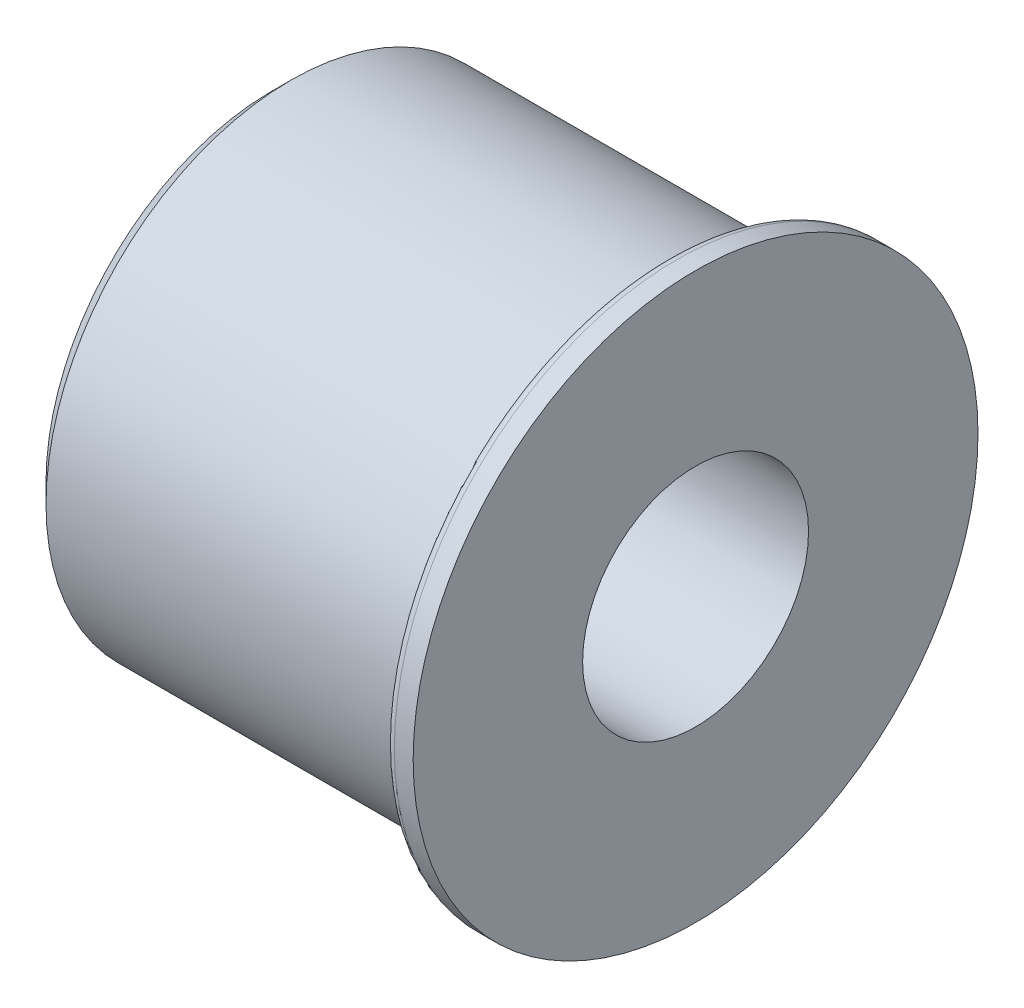
ISO-10303-21;
HEADER;
FILE_DESCRIPTION(('STEP AP214'),'2;1');
FILE_NAME('part.step','',(''),(''),'','','');
FILE_SCHEMA(('AUTOMOTIVE_DESIGN { 1 0 10303 214 1 1 1 1 }'));
ENDSEC;
DATA;
#1=APPLICATION_CONTEXT('core data for automotive mechanical design processes');
#2=APPLICATION_PROTOCOL_DEFINITION('international standard','automotive_design',2000,#1);
#3=PRODUCT_CONTEXT('',#1,'mechanical');
#4=PRODUCT('Part','Part','',(#3));
#5=PRODUCT_RELATED_PRODUCT_CATEGORY('part','',(#4));
#6=PRODUCT_DEFINITION_FORMATION('','',#4);
#7=PRODUCT_DEFINITION_CONTEXT('part definition',#1,'design');
#8=PRODUCT_DEFINITION('design','',#6,#7);
#9=PRODUCT_DEFINITION_SHAPE('','',#8);
#10=(LENGTH_UNIT() NAMED_UNIT(*) SI_UNIT(.MILLI.,.METRE.));
#11=(NAMED_UNIT(*) PLANE_ANGLE_UNIT() SI_UNIT($,.RADIAN.));
#12=(NAMED_UNIT(*) SI_UNIT($,.STERADIAN.) SOLID_ANGLE_UNIT());
#13=UNCERTAINTY_MEASURE_WITH_UNIT(LENGTH_MEASURE(1.E-05),#10,'distance_accuracy_value','');
#14=(GEOMETRIC_REPRESENTATION_CONTEXT(3) GLOBAL_UNCERTAINTY_ASSIGNED_CONTEXT((#13)) GLOBAL_UNIT_ASSIGNED_CONTEXT((#10,
#11,#12)) REPRESENTATION_CONTEXT('',''));
#15=CARTESIAN_POINT('',(0.,0.,0.));
#16=DIRECTION('',(0.,0.,1.));
#17=DIRECTION('',(1.,0.,0.));
#18=AXIS2_PLACEMENT_3D('',#15,#16,#17);
#19=CARTESIAN_POINT('',(0.,0.,0.));
#20=DIRECTION('',(-1.,0.,0.));
#21=DIRECTION('',(0.,0.,1.));
#22=AXIS2_PLACEMENT_3D('',#19,#20,#21);
#23=CYLINDRICAL_SURFACE('',#22,15.);
#24=CARTESIAN_POINT('',(21.5,0.,0.));
#25=DIRECTION('',(-1.,0.,0.));
#26=DIRECTION('',(0.,0.,1.));
#27=AXIS2_PLACEMENT_3D('',#24,#25,#26);
#28=CIRCLE('',#27,15.);
#29=CARTESIAN_POINT('',(21.5,0.,15.));
#30=VERTEX_POINT('',#29);
#31=EDGE_CURVE('E10',#30,#30,#28,.T.);
#32=ORIENTED_EDGE('',*,*,#31,.F.);
#33=EDGE_LOOP('',(#32));
#34=FACE_BOUND('',#33,.T.);
#35=CARTESIAN_POINT('',(22.5,0.,0.));
#36=DIRECTION('',(-1.,0.,0.));
#37=DIRECTION('',(0.,0.,1.));
#38=AXIS2_PLACEMENT_3D('',#35,#36,#37);
#39=CIRCLE('',#38,15.);
#40=CARTESIAN_POINT('',(22.5,0.,15.));
#41=VERTEX_POINT('',#40);
#42=EDGE_CURVE('E61',#41,#41,#39,.T.);
#43=ORIENTED_EDGE('',*,*,#42,.T.);
#44=EDGE_LOOP('',(#43));
#45=FACE_BOUND('',#44,.T.);
#46=ADVANCED_FACE('F33',(#34,#45),#23,.T.);
#47=CARTESIAN_POINT('',(21.5,0.,0.));
#48=DIRECTION('',(-1.,0.,0.));
#49=DIRECTION('',(0.,0.,1.));
#50=AXIS2_PLACEMENT_3D('',#47,#48,#49);
#51=TOROIDAL_SURFACE('',#50,14.5,0.500000000000001);
#52=CARTESIAN_POINT('',(21.,0.,0.));
#53=DIRECTION('',(-1.,0.,0.));
#54=DIRECTION('',(0.,0.,1.));
#55=AXIS2_PLACEMENT_3D('',#52,#53,#54);
#56=CIRCLE('',#55,14.5);
#57=CARTESIAN_POINT('',(21.,0.,14.5));
#58=VERTEX_POINT('',#57);
#59=EDGE_CURVE('E39',#58,#58,#56,.T.);
#60=ORIENTED_EDGE('',*,*,#59,.F.);
#61=EDGE_LOOP('',(#60));
#62=FACE_BOUND('',#61,.T.);
#63=ORIENTED_EDGE('',*,*,#31,.T.);
#64=EDGE_LOOP('',(#63));
#65=FACE_BOUND('',#64,.T.);
#66=ADVANCED_FACE('F98',(#62,#65),#51,.T.);
#67=CARTESIAN_POINT('',(21.,14.5,0.));
#68=DIRECTION('',(1.,0.,0.));
#69=DIRECTION('',(0.,0.,-1.));
#70=AXIS2_PLACEMENT_3D('',#67,#68,#69);
#71=PLANE('',#70);
#72=CARTESIAN_POINT('',(21.,0.,0.));
#73=DIRECTION('',(-1.,0.,0.));
#74=DIRECTION('',(0.,0.,1.));
#75=AXIS2_PLACEMENT_3D('',#72,#73,#74);
#76=CIRCLE('',#75,13.);
#77=CARTESIAN_POINT('',(21.,0.,13.));
#78=VERTEX_POINT('',#77);
#79=EDGE_CURVE('E43',#78,#78,#76,.T.);
#80=ORIENTED_EDGE('',*,*,#79,.F.);
#81=EDGE_LOOP('',(#80));
#82=FACE_BOUND('',#81,.T.);
#83=ORIENTED_EDGE('',*,*,#59,.T.);
#84=EDGE_LOOP('',(#83));
#85=FACE_BOUND('',#84,.T.);
#86=ADVANCED_FACE('F93',(#82,#85),#71,.F.);
#87=CARTESIAN_POINT('',(0.,0.,0.));
#88=DIRECTION('',(-1.,0.,0.));
#89=DIRECTION('',(0.,0.,1.));
#90=AXIS2_PLACEMENT_3D('',#87,#88,#89);
#91=CYLINDRICAL_SURFACE('',#90,13.);
#92=CARTESIAN_POINT('',(1.,0.,0.));
#93=DIRECTION('',(-1.,0.,0.));
#94=DIRECTION('',(0.,0.,1.));
#95=AXIS2_PLACEMENT_3D('',#92,#93,#94);
#96=CIRCLE('',#95,13.);
#97=CARTESIAN_POINT('',(1.,0.,13.));
#98=VERTEX_POINT('',#97);
#99=EDGE_CURVE('E47',#98,#98,#96,.T.);
#100=ORIENTED_EDGE('',*,*,#99,.F.);
#101=EDGE_LOOP('',(#100));
#102=FACE_BOUND('',#101,.T.);
#103=ORIENTED_EDGE('',*,*,#79,.T.);
#104=EDGE_LOOP('',(#103));
#105=FACE_BOUND('',#104,.T.);
#106=ADVANCED_FACE('F87',(#102,#105),#91,.T.);
#107=CARTESIAN_POINT('',(1.,0.,0.));
#108=DIRECTION('',(1.,0.,0.));
#109=DIRECTION('',(0.,0.,-1.));
#110=AXIS2_PLACEMENT_3D('',#107,#108,#109);
#111=CONICAL_SURFACE('',#110,13.,0.785398163397449);
#112=CARTESIAN_POINT('',(0.,0.,0.));
#113=DIRECTION('',(-1.,0.,0.));
#114=DIRECTION('',(0.,0.,1.));
#115=AXIS2_PLACEMENT_3D('',#112,#113,#114);
#116=CIRCLE('',#115,12.);
#117=CARTESIAN_POINT('',(0.,0.,12.));
#118=VERTEX_POINT('',#117);
#119=EDGE_CURVE('E52',#118,#118,#116,.T.);
#120=ORIENTED_EDGE('',*,*,#119,.F.);
#121=EDGE_LOOP('',(#120));
#122=FACE_BOUND('',#121,.T.);
#123=ORIENTED_EDGE('',*,*,#99,.T.);
#124=EDGE_LOOP('',(#123));
#125=FACE_BOUND('',#124,.T.);
#126=ADVANCED_FACE('F81',(#122,#125),#111,.T.);
#127=CARTESIAN_POINT('',(0.,6.,0.));
#128=DIRECTION('',(1.,0.,0.));
#129=DIRECTION('',(0.,0.,-1.));
#130=AXIS2_PLACEMENT_3D('',#127,#128,#129);
#131=PLANE('',#130);
#132=CARTESIAN_POINT('',(0.,0.,0.));
#133=DIRECTION('',(-1.,0.,0.));
#134=DIRECTION('',(0.,0.,1.));
#135=AXIS2_PLACEMENT_3D('',#132,#133,#134);
#136=CIRCLE('',#135,6.);
#137=CARTESIAN_POINT('',(0.,0.,6.));
#138=VERTEX_POINT('',#137);
#139=EDGE_CURVE('E55',#138,#138,#136,.T.);
#140=ORIENTED_EDGE('',*,*,#139,.F.);
#141=EDGE_LOOP('',(#140));
#142=FACE_BOUND('',#141,.T.);
#143=ORIENTED_EDGE('',*,*,#119,.T.);
#144=EDGE_LOOP('',(#143));
#145=FACE_BOUND('',#144,.T.);
#146=ADVANCED_FACE('F75',(#142,#145),#131,.F.);
#147=CARTESIAN_POINT('',(0.,0.,0.));
#148=DIRECTION('',(-1.,0.,0.));
#149=DIRECTION('',(0.,0.,1.));
#150=AXIS2_PLACEMENT_3D('',#147,#148,#149);
#151=CYLINDRICAL_SURFACE('',#150,6.);
#152=CARTESIAN_POINT('',(22.5,0.,0.));
#153=DIRECTION('',(-1.,0.,0.));
#154=DIRECTION('',(0.,0.,1.));
#155=AXIS2_PLACEMENT_3D('',#152,#153,#154);
#156=CIRCLE('',#155,6.);
#157=CARTESIAN_POINT('',(22.5,0.,6.));
#158=VERTEX_POINT('',#157);
#159=EDGE_CURVE('E58',#158,#158,#156,.T.);
#160=ORIENTED_EDGE('',*,*,#159,.F.);
#161=EDGE_LOOP('',(#160));
#162=FACE_BOUND('',#161,.T.);
#163=ORIENTED_EDGE('',*,*,#139,.T.);
#164=EDGE_LOOP('',(#163));
#165=FACE_BOUND('',#164,.T.);
#166=ADVANCED_FACE('F69',(#162,#165),#151,.F.);
#167=CARTESIAN_POINT('',(22.5,6.,0.));
#168=DIRECTION('',(-1.,0.,0.));
#169=DIRECTION('',(0.,0.,1.));
#170=AXIS2_PLACEMENT_3D('',#167,#168,#169);
#171=PLANE('',#170);
#172=ORIENTED_EDGE('',*,*,#42,.F.);
#173=EDGE_LOOP('',(#172));
#174=FACE_BOUND('',#173,.T.);
#175=ORIENTED_EDGE('',*,*,#159,.T.);
#176=EDGE_LOOP('',(#175));
#177=FACE_BOUND('',#176,.T.);
#178=ADVANCED_FACE('F66',(#174,#177),#171,.F.);
#179=CLOSED_SHELL('',(#46,#66,#86,#106,#126,#146,#166,#178));
#180=MANIFOLD_SOLID_BREP('B2',#179);
#181=ADVANCED_BREP_SHAPE_REPRESENTATION('',(#18,#180),#14);
#182=SHAPE_DEFINITION_REPRESENTATION(#9,#181);
ENDSEC;
END-ISO-10303-21;
